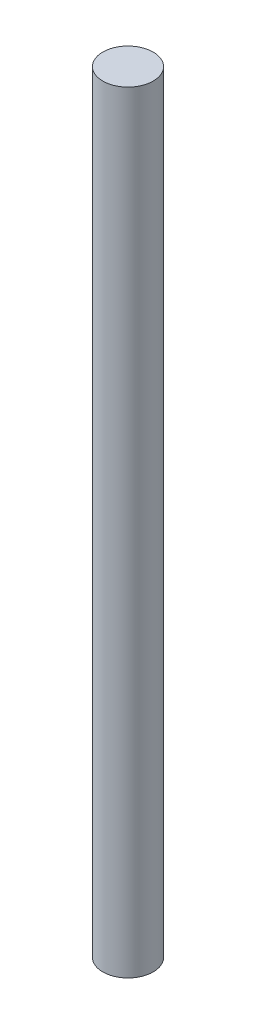
ISO-10303-21;
HEADER;
FILE_DESCRIPTION(('STEP AP214'),'2;1');
FILE_NAME('part.step','',(''),(''),'','','');
FILE_SCHEMA(('AUTOMOTIVE_DESIGN { 1 0 10303 214 1 1 1 1 }'));
ENDSEC;
DATA;
#1=APPLICATION_CONTEXT('core data for automotive mechanical design processes');
#2=APPLICATION_PROTOCOL_DEFINITION('international standard','automotive_design',2000,#1);
#3=PRODUCT_CONTEXT('',#1,'mechanical');
#4=PRODUCT('Part','Part','',(#3));
#5=PRODUCT_RELATED_PRODUCT_CATEGORY('part','',(#4));
#6=PRODUCT_DEFINITION_FORMATION('','',#4);
#7=PRODUCT_DEFINITION_CONTEXT('part definition',#1,'design');
#8=PRODUCT_DEFINITION('design','',#6,#7);
#9=PRODUCT_DEFINITION_SHAPE('','',#8);
#10=(LENGTH_UNIT() NAMED_UNIT(*) SI_UNIT(.MILLI.,.METRE.));
#11=(NAMED_UNIT(*) PLANE_ANGLE_UNIT() SI_UNIT($,.RADIAN.));
#12=(NAMED_UNIT(*) SI_UNIT($,.STERADIAN.) SOLID_ANGLE_UNIT());
#13=UNCERTAINTY_MEASURE_WITH_UNIT(LENGTH_MEASURE(1.E-05),#10,'distance_accuracy_value','');
#14=(GEOMETRIC_REPRESENTATION_CONTEXT(3) GLOBAL_UNCERTAINTY_ASSIGNED_CONTEXT((#13)) GLOBAL_UNIT_ASSIGNED_CONTEXT((#10,
#11,#12)) REPRESENTATION_CONTEXT('',''));
#15=CARTESIAN_POINT('',(0.,0.,0.));
#16=DIRECTION('',(0.,0.,1.));
#17=DIRECTION('',(1.,0.,0.));
#18=AXIS2_PLACEMENT_3D('',#15,#16,#17);
#19=CARTESIAN_POINT('',(0.,122.585779974,0.));
#20=DIRECTION('',(0.,-1.,0.));
#21=DIRECTION('',(0.,0.,-1.));
#22=AXIS2_PLACEMENT_3D('',#19,#20,#21);
#23=CYLINDRICAL_SURFACE('',#22,4.);
#24=CARTESIAN_POINT('',(0.,122.585779974,0.));
#25=DIRECTION('',(0.,1.,0.));
#26=DIRECTION('',(0.,0.,1.));
#27=AXIS2_PLACEMENT_3D('',#24,#25,#26);
#28=CIRCLE('',#27,4.);
#29=CARTESIAN_POINT('',(0.,122.585779974,4.));
#30=VERTEX_POINT('',#29);
#31=EDGE_CURVE('E10',#30,#30,#28,.T.);
#32=ORIENTED_EDGE('',*,*,#31,.F.);
#33=EDGE_LOOP('',(#32));
#34=FACE_BOUND('',#33,.T.);
#35=CARTESIAN_POINT('',(0.,0.,0.));
#36=DIRECTION('',(0.,1.,0.));
#37=DIRECTION('',(0.,0.,1.));
#38=AXIS2_PLACEMENT_3D('',#35,#36,#37);
#39=CIRCLE('',#38,4.);
#40=CARTESIAN_POINT('',(0.,0.,4.));
#41=VERTEX_POINT('',#40);
#42=EDGE_CURVE('E34',#41,#41,#39,.T.);
#43=ORIENTED_EDGE('',*,*,#42,.T.);
#44=EDGE_LOOP('',(#43));
#45=FACE_BOUND('',#44,.T.);
#46=ADVANCED_FACE('F31',(#34,#45),#23,.T.);
#47=CARTESIAN_POINT('',(0.,122.585779974,0.));
#48=DIRECTION('',(0.,1.,0.));
#49=DIRECTION('',(0.,0.,1.));
#50=AXIS2_PLACEMENT_3D('',#47,#48,#49);
#51=PLANE('',#50);
#52=ORIENTED_EDGE('',*,*,#31,.T.);
#53=EDGE_LOOP('',(#52));
#54=FACE_BOUND('',#53,.T.);
#55=ADVANCED_FACE('F46',(#54),#51,.T.);
#56=CARTESIAN_POINT('',(0.,0.,0.));
#57=DIRECTION('',(0.,1.,0.));
#58=DIRECTION('',(0.,0.,1.));
#59=AXIS2_PLACEMENT_3D('',#56,#57,#58);
#60=PLANE('',#59);
#61=ORIENTED_EDGE('',*,*,#42,.F.);
#62=EDGE_LOOP('',(#61));
#63=FACE_BOUND('',#62,.T.);
#64=ADVANCED_FACE('F44',(#63),#60,.F.);
#65=CLOSED_SHELL('',(#46,#55,#64));
#66=MANIFOLD_SOLID_BREP('B2',#65);
#67=ADVANCED_BREP_SHAPE_REPRESENTATION('',(#18,#66),#14);
#68=SHAPE_DEFINITION_REPRESENTATION(#9,#67);
ENDSEC;
END-ISO-10303-21;
